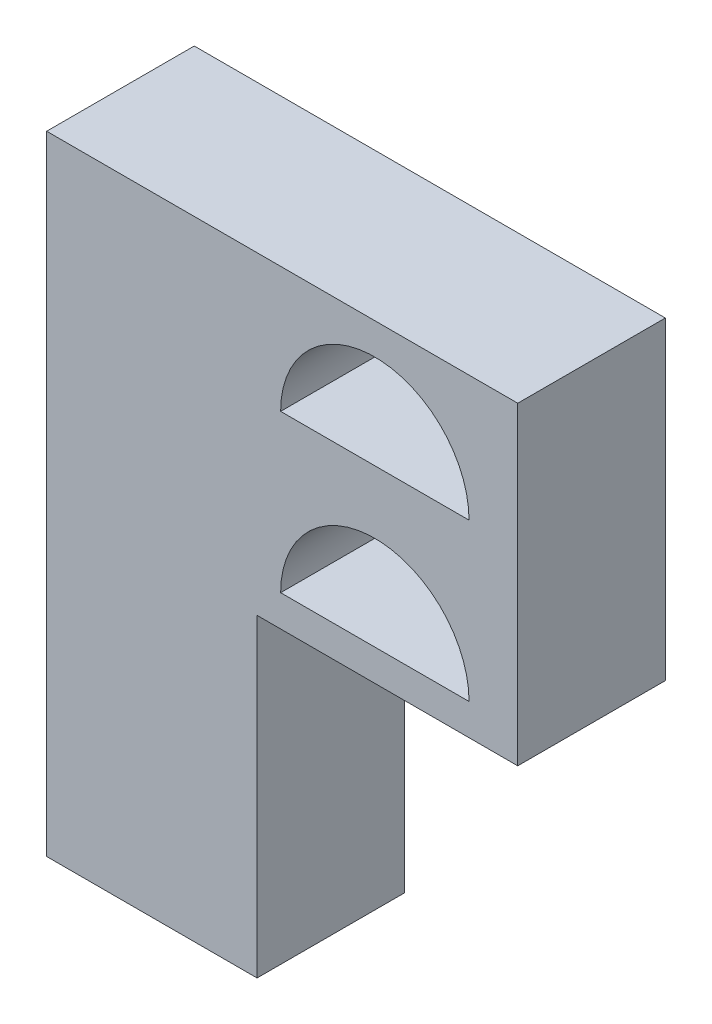
ISO-10303-21;
HEADER;
FILE_DESCRIPTION(('STEP AP214'),'2;1');
FILE_NAME('part.step','',(''),(''),'','','');
FILE_SCHEMA(('AUTOMOTIVE_DESIGN { 1 0 10303 214 1 1 1 1 }'));
ENDSEC;
DATA;
#1=APPLICATION_CONTEXT('core data for automotive mechanical design processes');
#2=APPLICATION_PROTOCOL_DEFINITION('international standard','automotive_design',2000,#1);
#3=PRODUCT_CONTEXT('',#1,'mechanical');
#4=PRODUCT('Part','Part','',(#3));
#5=PRODUCT_RELATED_PRODUCT_CATEGORY('part','',(#4));
#6=PRODUCT_DEFINITION_FORMATION('','',#4);
#7=PRODUCT_DEFINITION_CONTEXT('part definition',#1,'design');
#8=PRODUCT_DEFINITION('design','',#6,#7);
#9=PRODUCT_DEFINITION_SHAPE('','',#8);
#10=(LENGTH_UNIT() NAMED_UNIT(*) SI_UNIT(.MILLI.,.METRE.));
#11=(NAMED_UNIT(*) PLANE_ANGLE_UNIT() SI_UNIT($,.RADIAN.));
#12=(NAMED_UNIT(*) SI_UNIT($,.STERADIAN.) SOLID_ANGLE_UNIT());
#13=UNCERTAINTY_MEASURE_WITH_UNIT(LENGTH_MEASURE(1.E-05),#10,'distance_accuracy_value','');
#14=(GEOMETRIC_REPRESENTATION_CONTEXT(3) GLOBAL_UNCERTAINTY_ASSIGNED_CONTEXT((#13)) GLOBAL_UNIT_ASSIGNED_CONTEXT((#10,
#11,#12)) REPRESENTATION_CONTEXT('',''));
#15=CARTESIAN_POINT('',(0.,0.,0.));
#16=DIRECTION('',(0.,0.,1.));
#17=DIRECTION('',(1.,0.,0.));
#18=AXIS2_PLACEMENT_3D('',#15,#16,#17);
#19=CARTESIAN_POINT('',(11.65,0.,4.7));
#20=DIRECTION('',(1.,0.,0.));
#21=DIRECTION('',(0.,1.,0.));
#22=AXIS2_PLACEMENT_3D('',#19,#20,#21);
#23=PLANE('',#22);
#24=DIRECTION('',(0.,-1.,0.));
#25=VECTOR('',#24,1.);
#26=CARTESIAN_POINT('',(11.65,0.,0.));
#27=LINE('',#26,#25);
#28=CARTESIAN_POINT('',(11.65,15.,0.));
#29=VERTEX_POINT('',#28);
#30=CARTESIAN_POINT('',(11.65,5.,0.));
#31=VERTEX_POINT('',#30);
#32=EDGE_CURVE('E272',#29,#31,#27,.T.);
#33=ORIENTED_EDGE('',*,*,#32,.F.);
#34=DIRECTION('',(0.,0.,-1.));
#35=VECTOR('',#34,1.);
#36=CARTESIAN_POINT('',(11.65,15.,4.7));
#37=LINE('',#36,#35);
#38=CARTESIAN_POINT('',(11.65,15.,4.7));
#39=VERTEX_POINT('',#38);
#40=EDGE_CURVE('E11',#39,#29,#37,.T.);
#41=ORIENTED_EDGE('',*,*,#40,.F.);
#42=DIRECTION('',(0.,-1.,0.));
#43=VECTOR('',#42,1.);
#44=CARTESIAN_POINT('',(11.65,0.,4.7));
#45=LINE('',#44,#43);
#46=CARTESIAN_POINT('',(11.65,5.,4.7));
#47=VERTEX_POINT('',#46);
#48=EDGE_CURVE('E244',#39,#47,#45,.T.);
#49=ORIENTED_EDGE('',*,*,#48,.T.);
#50=DIRECTION('',(0.,0.,-1.));
#51=VECTOR('',#50,1.);
#52=CARTESIAN_POINT('',(11.65,5.,4.7));
#53=LINE('',#52,#51);
#54=EDGE_CURVE('E289',#47,#31,#53,.T.);
#55=ORIENTED_EDGE('',*,*,#54,.T.);
#56=EDGE_LOOP('',(#33,#41,#49,#55));
#57=FACE_BOUND('',#56,.T.);
#58=ADVANCED_FACE('F38',(#57),#23,.T.);
#59=CARTESIAN_POINT('',(0.,15.,4.7));
#60=DIRECTION('',(0.,1.,0.));
#61=DIRECTION('',(0.,0.,1.));
#62=AXIS2_PLACEMENT_3D('',#59,#60,#61);
#63=PLANE('',#62);
#64=DIRECTION('',(1.,0.,0.));
#65=VECTOR('',#64,1.);
#66=CARTESIAN_POINT('',(0.,15.,0.));
#67=LINE('',#66,#65);
#68=CARTESIAN_POINT('',(-3.35,15.,0.));
#69=VERTEX_POINT('',#68);
#70=EDGE_CURVE('E275',#69,#29,#67,.T.);
#71=ORIENTED_EDGE('',*,*,#70,.F.);
#72=DIRECTION('',(0.,0.,-1.));
#73=VECTOR('',#72,1.);
#74=CARTESIAN_POINT('',(-3.35,15.,4.7));
#75=LINE('',#74,#73);
#76=CARTESIAN_POINT('',(-3.35,15.,4.7));
#77=VERTEX_POINT('',#76);
#78=EDGE_CURVE('E47',#77,#69,#75,.T.);
#79=ORIENTED_EDGE('',*,*,#78,.F.);
#80=DIRECTION('',(1.,0.,0.));
#81=VECTOR('',#80,1.);
#82=CARTESIAN_POINT('',(0.,15.,4.7));
#83=LINE('',#82,#81);
#84=EDGE_CURVE('E247',#77,#39,#83,.T.);
#85=ORIENTED_EDGE('',*,*,#84,.T.);
#86=ORIENTED_EDGE('',*,*,#40,.T.);
#87=EDGE_LOOP('',(#71,#79,#85,#86));
#88=FACE_BOUND('',#87,.T.);
#89=ADVANCED_FACE('F325',(#88),#63,.T.);
#90=CARTESIAN_POINT('',(-3.35,0.,4.7));
#91=DIRECTION('',(-1.,0.,0.));
#92=DIRECTION('',(0.,-1.,0.));
#93=AXIS2_PLACEMENT_3D('',#90,#91,#92);
#94=PLANE('',#93);
#95=DIRECTION('',(0.,1.,0.));
#96=VECTOR('',#95,1.);
#97=CARTESIAN_POINT('',(-3.35,14.3472478665135,3.85));
#98=LINE('',#97,#96);
#99=CARTESIAN_POINT('',(-3.35,10.8472478665135,3.85));
#100=VERTEX_POINT('',#99);
#101=CARTESIAN_POINT('',(-3.35,14.3472478665135,3.85));
#102=VERTEX_POINT('',#101);
#103=EDGE_CURVE('E55',#100,#102,#98,.T.);
#104=ORIENTED_EDGE('',*,*,#103,.F.);
#105=DIRECTION('',(0.,0.,1.));
#106=VECTOR('',#105,1.);
#107=CARTESIAN_POINT('',(-3.35,10.8472478665135,0.849999999999997));
#108=LINE('',#107,#106);
#109=CARTESIAN_POINT('',(-3.35,10.8472478665135,0.849999999999997));
#110=VERTEX_POINT('',#109);
#111=EDGE_CURVE('E184',#110,#100,#108,.T.);
#112=ORIENTED_EDGE('',*,*,#111,.F.);
#113=DIRECTION('',(0.,-1.,0.));
#114=VECTOR('',#113,1.);
#115=CARTESIAN_POINT('',(-3.35,14.3472478665135,0.849999999999996));
#116=LINE('',#115,#114);
#117=CARTESIAN_POINT('',(-3.35,14.3472478665135,0.849999999999996));
#118=VERTEX_POINT('',#117);
#119=EDGE_CURVE('E187',#118,#110,#116,.T.);
#120=ORIENTED_EDGE('',*,*,#119,.F.);
#121=DIRECTION('',(0.,0.,-1.));
#122=VECTOR('',#121,1.);
#123=CARTESIAN_POINT('',(-3.35,14.3472478665135,0.849999999999996));
#124=LINE('',#123,#122);
#125=EDGE_CURVE('E193',#102,#118,#124,.T.);
#126=ORIENTED_EDGE('',*,*,#125,.F.);
#127=EDGE_LOOP('',(#104,#112,#120,#126));
#128=FACE_BOUND('',#127,.T.);
#129=DIRECTION('',(0.,-1.,0.));
#130=VECTOR('',#129,1.);
#131=CARTESIAN_POINT('',(-3.35,5.8472478665135,0.849999999999993));
#132=LINE('',#131,#130);
#133=CARTESIAN_POINT('',(-3.35,9.3472478665135,0.849999999999996));
#134=VERTEX_POINT('',#133);
#135=CARTESIAN_POINT('',(-3.35,5.8472478665135,0.849999999999993));
#136=VERTEX_POINT('',#135);
#137=EDGE_CURVE('E63',#134,#136,#132,.T.);
#138=ORIENTED_EDGE('',*,*,#137,.F.);
#139=DIRECTION('',(0.,0.,-1.));
#140=VECTOR('',#139,1.);
#141=CARTESIAN_POINT('',(-3.35,9.3472478665135,0.849999999999996));
#142=LINE('',#141,#140);
#143=CARTESIAN_POINT('',(-3.35,9.3472478665135,3.85));
#144=VERTEX_POINT('',#143);
#145=EDGE_CURVE('E208',#144,#134,#142,.T.);
#146=ORIENTED_EDGE('',*,*,#145,.F.);
#147=DIRECTION('',(0.,1.,0.));
#148=VECTOR('',#147,1.);
#149=CARTESIAN_POINT('',(-3.35,5.8472478665135,3.84999999999999));
#150=LINE('',#149,#148);
#151=CARTESIAN_POINT('',(-3.35,5.8472478665135,3.84999999999999));
#152=VERTEX_POINT('',#151);
#153=EDGE_CURVE('E222',#152,#144,#150,.T.);
#154=ORIENTED_EDGE('',*,*,#153,.F.);
#155=DIRECTION('',(0.,0.,1.));
#156=VECTOR('',#155,1.);
#157=CARTESIAN_POINT('',(-3.35,5.8472478665135,0.849999999999993));
#158=LINE('',#157,#156);
#159=EDGE_CURVE('E219',#136,#152,#158,.T.);
#160=ORIENTED_EDGE('',*,*,#159,.F.);
#161=EDGE_LOOP('',(#138,#146,#154,#160));
#162=FACE_BOUND('',#161,.T.);
#163=DIRECTION('',(0.,1.,0.));
#164=VECTOR('',#163,1.);
#165=CARTESIAN_POINT('',(-3.35,0.,0.));
#166=LINE('',#165,#164);
#167=CARTESIAN_POINT('',(-3.35,-5.,0.));
#168=VERTEX_POINT('',#167);
#169=EDGE_CURVE('E278',#168,#69,#166,.T.);
#170=ORIENTED_EDGE('',*,*,#169,.F.);
#171=DIRECTION('',(0.,0.,-1.));
#172=VECTOR('',#171,1.);
#173=CARTESIAN_POINT('',(-3.35,-5.,4.7));
#174=LINE('',#173,#172);
#175=CARTESIAN_POINT('',(-3.35,-5.,4.7));
#176=VERTEX_POINT('',#175);
#177=EDGE_CURVE('E296',#176,#168,#174,.T.);
#178=ORIENTED_EDGE('',*,*,#177,.F.);
#179=DIRECTION('',(0.,1.,0.));
#180=VECTOR('',#179,1.);
#181=CARTESIAN_POINT('',(-3.35,0.,4.7));
#182=LINE('',#181,#180);
#183=EDGE_CURVE('E250',#176,#77,#182,.T.);
#184=ORIENTED_EDGE('',*,*,#183,.T.);
#185=ORIENTED_EDGE('',*,*,#78,.T.);
#186=EDGE_LOOP('',(#170,#178,#184,#185));
#187=FACE_BOUND('',#186,.T.);
#188=ADVANCED_FACE('F331',(#128,#162,#187),#94,.T.);
#189=CARTESIAN_POINT('',(0.,-5.,4.7));
#190=DIRECTION('',(0.,1.,0.));
#191=DIRECTION('',(0.,0.,1.));
#192=AXIS2_PLACEMENT_3D('',#189,#190,#191);
#193=PLANE('',#192);
#194=DIRECTION('',(1.,0.,0.));
#195=VECTOR('',#194,1.);
#196=CARTESIAN_POINT('',(0.,-5.,0.));
#197=LINE('',#196,#195);
#198=CARTESIAN_POINT('',(3.35,-5.,0.));
#199=VERTEX_POINT('',#198);
#200=EDGE_CURVE('E281',#168,#199,#197,.T.);
#201=ORIENTED_EDGE('',*,*,#200,.T.);
#202=DIRECTION('',(0.,0.,-1.));
#203=VECTOR('',#202,1.);
#204=CARTESIAN_POINT('',(3.35,-5.,4.7));
#205=LINE('',#204,#203);
#206=CARTESIAN_POINT('',(3.35,-5.,4.7));
#207=VERTEX_POINT('',#206);
#208=EDGE_CURVE('E294',#207,#199,#205,.T.);
#209=ORIENTED_EDGE('',*,*,#208,.F.);
#210=DIRECTION('',(1.,0.,0.));
#211=VECTOR('',#210,1.);
#212=CARTESIAN_POINT('',(0.,-5.,4.7));
#213=LINE('',#212,#211);
#214=EDGE_CURVE('E253',#176,#207,#213,.T.);
#215=ORIENTED_EDGE('',*,*,#214,.F.);
#216=ORIENTED_EDGE('',*,*,#177,.T.);
#217=EDGE_LOOP('',(#201,#209,#215,#216));
#218=FACE_BOUND('',#217,.T.);
#219=ADVANCED_FACE('F353',(#218),#193,.F.);
#220=CARTESIAN_POINT('',(3.35,0.,4.7));
#221=DIRECTION('',(1.,0.,0.));
#222=DIRECTION('',(0.,1.,0.));
#223=AXIS2_PLACEMENT_3D('',#220,#221,#222);
#224=PLANE('',#223);
#225=DIRECTION('',(0.,-1.,0.));
#226=VECTOR('',#225,1.);
#227=CARTESIAN_POINT('',(3.35,0.,0.));
#228=LINE('',#227,#226);
#229=CARTESIAN_POINT('',(3.35,5.,0.));
#230=VERTEX_POINT('',#229);
#231=EDGE_CURVE('E284',#230,#199,#228,.T.);
#232=ORIENTED_EDGE('',*,*,#231,.F.);
#233=DIRECTION('',(0.,0.,-1.));
#234=VECTOR('',#233,1.);
#235=CARTESIAN_POINT('',(3.35,5.,4.7));
#236=LINE('',#235,#234);
#237=CARTESIAN_POINT('',(3.35,5.,4.7));
#238=VERTEX_POINT('',#237);
#239=EDGE_CURVE('E291',#238,#230,#236,.T.);
#240=ORIENTED_EDGE('',*,*,#239,.F.);
#241=DIRECTION('',(0.,-1.,0.));
#242=VECTOR('',#241,1.);
#243=CARTESIAN_POINT('',(3.35,0.,4.7));
#244=LINE('',#243,#242);
#245=EDGE_CURVE('E255',#238,#207,#244,.T.);
#246=ORIENTED_EDGE('',*,*,#245,.T.);
#247=ORIENTED_EDGE('',*,*,#208,.T.);
#248=EDGE_LOOP('',(#232,#240,#246,#247));
#249=FACE_BOUND('',#248,.T.);
#250=ADVANCED_FACE('F321',(#249),#224,.T.);
#251=CARTESIAN_POINT('',(7.1,11.,4.7));
#252=DIRECTION('',(0.,0.,-1.));
#253=DIRECTION('',(-1.,0.,0.));
#254=AXIS2_PLACEMENT_3D('',#251,#252,#253);
#255=CYLINDRICAL_SURFACE('',#254,3.);
#256=CARTESIAN_POINT('',(7.1,11.,0.));
#257=DIRECTION('',(0.,0.,1.));
#258=DIRECTION('',(1.,0.,0.));
#259=AXIS2_PLACEMENT_3D('',#256,#257,#258);
#260=CIRCLE('',#259,3.);
#261=CARTESIAN_POINT('',(10.1,11.,0.));
#262=VERTEX_POINT('',#261);
#263=CARTESIAN_POINT('',(4.1,11.,0.));
#264=VERTEX_POINT('',#263);
#265=EDGE_CURVE('E266',#262,#264,#260,.T.);
#266=ORIENTED_EDGE('',*,*,#265,.F.);
#267=DIRECTION('',(0.,0.,-1.));
#268=VECTOR('',#267,1.);
#269=CARTESIAN_POINT('',(10.1,11.,4.7));
#270=LINE('',#269,#268);
#271=CARTESIAN_POINT('',(10.1,11.,4.7));
#272=VERTEX_POINT('',#271);
#273=EDGE_CURVE('E292',#272,#262,#270,.T.);
#274=ORIENTED_EDGE('',*,*,#273,.F.);
#275=CARTESIAN_POINT('',(7.1,11.,4.7));
#276=DIRECTION('',(0.,0.,1.));
#277=DIRECTION('',(1.,0.,0.));
#278=AXIS2_PLACEMENT_3D('',#275,#276,#277);
#279=CIRCLE('',#278,3.);
#280=CARTESIAN_POINT('',(4.1,11.,4.7));
#281=VERTEX_POINT('',#280);
#282=EDGE_CURVE('E239',#272,#281,#279,.T.);
#283=ORIENTED_EDGE('',*,*,#282,.T.);
#284=DIRECTION('',(0.,0.,-1.));
#285=VECTOR('',#284,1.);
#286=CARTESIAN_POINT('',(4.1,11.,4.7));
#287=LINE('',#286,#285);
#288=EDGE_CURVE('E299',#281,#264,#287,.T.);
#289=ORIENTED_EDGE('',*,*,#288,.T.);
#290=EDGE_LOOP('',(#266,#274,#283,#289));
#291=FACE_BOUND('',#290,.T.);
#292=ADVANCED_FACE('F314',(#291),#255,.F.);
#293=CARTESIAN_POINT('',(7.10000000000005,6.,4.7));
#294=DIRECTION('',(0.,0.,-1.));
#295=DIRECTION('',(-1.,0.,0.));
#296=AXIS2_PLACEMENT_3D('',#293,#294,#295);
#297=CYLINDRICAL_SURFACE('',#296,3.);
#298=CARTESIAN_POINT('',(7.10000000000005,6.,0.));
#299=DIRECTION('',(0.,0.,1.));
#300=DIRECTION('',(1.,0.,0.));
#301=AXIS2_PLACEMENT_3D('',#298,#299,#300);
#302=CIRCLE('',#301,3.);
#303=CARTESIAN_POINT('',(10.1,6.,0.));
#304=VERTEX_POINT('',#303);
#305=CARTESIAN_POINT('',(4.10000000000005,6.,0.));
#306=VERTEX_POINT('',#305);
#307=EDGE_CURVE('E200',#304,#306,#302,.T.);
#308=ORIENTED_EDGE('',*,*,#307,.F.);
#309=DIRECTION('',(0.,0.,-1.));
#310=VECTOR('',#309,1.);
#311=CARTESIAN_POINT('',(10.1,6.,4.7));
#312=LINE('',#311,#310);
#313=CARTESIAN_POINT('',(10.1,6.,4.7));
#314=VERTEX_POINT('',#313);
#315=EDGE_CURVE('E42',#314,#304,#312,.T.);
#316=ORIENTED_EDGE('',*,*,#315,.F.);
#317=CARTESIAN_POINT('',(7.10000000000005,6.,4.7));
#318=DIRECTION('',(0.,0.,1.));
#319=DIRECTION('',(1.,0.,0.));
#320=AXIS2_PLACEMENT_3D('',#317,#318,#319);
#321=CIRCLE('',#320,3.);
#322=CARTESIAN_POINT('',(4.10000000000005,6.,4.7));
#323=VERTEX_POINT('',#322);
#324=EDGE_CURVE('E233',#314,#323,#321,.T.);
#325=ORIENTED_EDGE('',*,*,#324,.T.);
#326=DIRECTION('',(0.,0.,-1.));
#327=VECTOR('',#326,1.);
#328=CARTESIAN_POINT('',(4.10000000000005,6.,4.7));
#329=LINE('',#328,#327);
#330=EDGE_CURVE('E260',#323,#306,#329,.T.);
#331=ORIENTED_EDGE('',*,*,#330,.T.);
#332=EDGE_LOOP('',(#308,#316,#325,#331));
#333=FACE_BOUND('',#332,.T.);
#334=ADVANCED_FACE('F40',(#333),#297,.F.);
#335=CARTESIAN_POINT('',(0.,11.,4.7));
#336=DIRECTION('',(0.,-1.,0.));
#337=DIRECTION('',(1.,0.,0.));
#338=AXIS2_PLACEMENT_3D('',#335,#336,#337);
#339=PLANE('',#338);
#340=DIRECTION('',(-1.,0.,0.));
#341=VECTOR('',#340,1.);
#342=CARTESIAN_POINT('',(0.,11.,0.));
#343=LINE('',#342,#341);
#344=EDGE_CURVE('E269',#262,#264,#343,.T.);
#345=ORIENTED_EDGE('',*,*,#344,.T.);
#346=ORIENTED_EDGE('',*,*,#288,.F.);
#347=DIRECTION('',(-1.,0.,0.));
#348=VECTOR('',#347,1.);
#349=CARTESIAN_POINT('',(0.,11.,4.7));
#350=LINE('',#349,#348);
#351=EDGE_CURVE('E242',#272,#281,#350,.T.);
#352=ORIENTED_EDGE('',*,*,#351,.F.);
#353=ORIENTED_EDGE('',*,*,#273,.T.);
#354=EDGE_LOOP('',(#345,#346,#352,#353));
#355=FACE_BOUND('',#354,.T.);
#356=ADVANCED_FACE('F313',(#355),#339,.F.);
#357=CARTESIAN_POINT('',(0.,5.99999999999999,4.7));
#358=DIRECTION('',(0.,-1.,0.));
#359=DIRECTION('',(1.,0.,0.));
#360=AXIS2_PLACEMENT_3D('',#357,#358,#359);
#361=PLANE('',#360);
#362=DIRECTION('',(-1.,0.,0.));
#363=VECTOR('',#362,1.);
#364=CARTESIAN_POINT('',(0.,5.99999999999999,0.));
#365=LINE('',#364,#363);
#366=EDGE_CURVE('E263',#304,#306,#365,.T.);
#367=ORIENTED_EDGE('',*,*,#366,.T.);
#368=ORIENTED_EDGE('',*,*,#330,.F.);
#369=DIRECTION('',(-1.,0.,0.));
#370=VECTOR('',#369,1.);
#371=CARTESIAN_POINT('',(0.,5.99999999999999,4.7));
#372=LINE('',#371,#370);
#373=EDGE_CURVE('E236',#314,#323,#372,.T.);
#374=ORIENTED_EDGE('',*,*,#373,.F.);
#375=ORIENTED_EDGE('',*,*,#315,.T.);
#376=EDGE_LOOP('',(#367,#368,#374,#375));
#377=FACE_BOUND('',#376,.T.);
#378=ADVANCED_FACE('F307',(#377),#361,.F.);
#379=CARTESIAN_POINT('',(0.,5.,4.7));
#380=DIRECTION('',(0.,1.,0.));
#381=DIRECTION('',(0.,0.,1.));
#382=AXIS2_PLACEMENT_3D('',#379,#380,#381);
#383=PLANE('',#382);
#384=DIRECTION('',(1.,0.,0.));
#385=VECTOR('',#384,1.);
#386=CARTESIAN_POINT('',(0.,5.,0.));
#387=LINE('',#386,#385);
#388=EDGE_CURVE('E237',#230,#31,#387,.T.);
#389=ORIENTED_EDGE('',*,*,#388,.T.);
#390=ORIENTED_EDGE('',*,*,#54,.F.);
#391=DIRECTION('',(1.,0.,0.));
#392=VECTOR('',#391,1.);
#393=CARTESIAN_POINT('',(0.,5.,4.7));
#394=LINE('',#393,#392);
#395=EDGE_CURVE('E258',#238,#47,#394,.T.);
#396=ORIENTED_EDGE('',*,*,#395,.F.);
#397=ORIENTED_EDGE('',*,*,#239,.T.);
#398=EDGE_LOOP('',(#389,#390,#396,#397));
#399=FACE_BOUND('',#398,.T.);
#400=ADVANCED_FACE('F337',(#399),#383,.F.);
#401=CARTESIAN_POINT('',(0.,0.,4.7));
#402=DIRECTION('',(0.,0.,1.));
#403=DIRECTION('',(1.,0.,0.));
#404=AXIS2_PLACEMENT_3D('',#401,#402,#403);
#405=PLANE('',#404);
#406=ORIENTED_EDGE('',*,*,#324,.F.);
#407=ORIENTED_EDGE('',*,*,#373,.T.);
#408=EDGE_LOOP('',(#406,#407));
#409=FACE_BOUND('',#408,.T.);
#410=ORIENTED_EDGE('',*,*,#282,.F.);
#411=ORIENTED_EDGE('',*,*,#351,.T.);
#412=EDGE_LOOP('',(#410,#411));
#413=FACE_BOUND('',#412,.T.);
#414=ORIENTED_EDGE('',*,*,#48,.F.);
#415=ORIENTED_EDGE('',*,*,#84,.F.);
#416=ORIENTED_EDGE('',*,*,#183,.F.);
#417=ORIENTED_EDGE('',*,*,#214,.T.);
#418=ORIENTED_EDGE('',*,*,#245,.F.);
#419=ORIENTED_EDGE('',*,*,#395,.T.);
#420=EDGE_LOOP('',(#414,#415,#416,#417,#418,#419));
#421=FACE_BOUND('',#420,.T.);
#422=ADVANCED_FACE('F341',(#409,#413,#421),#405,.T.);
#423=CARTESIAN_POINT('',(0.,0.,0.));
#424=DIRECTION('',(0.,0.,1.));
#425=DIRECTION('',(1.,0.,0.));
#426=AXIS2_PLACEMENT_3D('',#423,#424,#425);
#427=PLANE('',#426);
#428=ORIENTED_EDGE('',*,*,#307,.T.);
#429=ORIENTED_EDGE('',*,*,#366,.F.);
#430=EDGE_LOOP('',(#428,#429));
#431=FACE_BOUND('',#430,.T.);
#432=ORIENTED_EDGE('',*,*,#265,.T.);
#433=ORIENTED_EDGE('',*,*,#344,.F.);
#434=EDGE_LOOP('',(#432,#433));
#435=FACE_BOUND('',#434,.T.);
#436=ORIENTED_EDGE('',*,*,#32,.T.);
#437=ORIENTED_EDGE('',*,*,#388,.F.);
#438=ORIENTED_EDGE('',*,*,#231,.T.);
#439=ORIENTED_EDGE('',*,*,#200,.F.);
#440=ORIENTED_EDGE('',*,*,#169,.T.);
#441=ORIENTED_EDGE('',*,*,#70,.T.);
#442=EDGE_LOOP('',(#436,#437,#438,#439,#440,#441));
#443=FACE_BOUND('',#442,.T.);
#444=ADVANCED_FACE('F310',(#431,#435,#443),#427,.F.);
#445=CARTESIAN_POINT('',(1.65,5.8472478665135,0.849999999999993));
#446=DIRECTION('',(0.,0.,-1.));
#447=DIRECTION('',(0.,1.,0.));
#448=AXIS2_PLACEMENT_3D('',#445,#446,#447);
#449=PLANE('',#448);
#450=ORIENTED_EDGE('',*,*,#137,.T.);
#451=DIRECTION('',(-1.,0.,0.));
#452=VECTOR('',#451,1.);
#453=CARTESIAN_POINT('',(1.65,5.8472478665135,0.849999999999993));
#454=LINE('',#453,#452);
#455=CARTESIAN_POINT('',(1.65,5.8472478665135,0.849999999999993));
#456=VERTEX_POINT('',#455);
#457=EDGE_CURVE('E217',#456,#136,#454,.T.);
#458=ORIENTED_EDGE('',*,*,#457,.F.);
#459=DIRECTION('',(0.,-1.,0.));
#460=VECTOR('',#459,1.);
#461=CARTESIAN_POINT('',(1.65,5.8472478665135,0.849999999999993));
#462=LINE('',#461,#460);
#463=CARTESIAN_POINT('',(1.65,9.3472478665135,0.849999999999996));
#464=VERTEX_POINT('',#463);
#465=EDGE_CURVE('E204',#464,#456,#462,.T.);
#466=ORIENTED_EDGE('',*,*,#465,.F.);
#467=DIRECTION('',(-1.,0.,0.));
#468=VECTOR('',#467,1.);
#469=CARTESIAN_POINT('',(1.65,9.3472478665135,0.849999999999996));
#470=LINE('',#469,#468);
#471=EDGE_CURVE('E194',#464,#134,#470,.T.);
#472=ORIENTED_EDGE('',*,*,#471,.T.);
#473=EDGE_LOOP('',(#450,#458,#466,#472));
#474=FACE_BOUND('',#473,.T.);
#475=ADVANCED_FACE('F382',(#474),#449,.F.);
#476=CARTESIAN_POINT('',(1.65,9.3472478665135,0.849999999999996));
#477=DIRECTION('',(0.,1.,0.));
#478=DIRECTION('',(0.,0.,1.));
#479=AXIS2_PLACEMENT_3D('',#476,#477,#478);
#480=PLANE('',#479);
#481=ORIENTED_EDGE('',*,*,#145,.T.);
#482=ORIENTED_EDGE('',*,*,#471,.F.);
#483=DIRECTION('',(0.,0.,-1.));
#484=VECTOR('',#483,1.);
#485=CARTESIAN_POINT('',(1.65,9.3472478665135,0.849999999999996));
#486=LINE('',#485,#484);
#487=CARTESIAN_POINT('',(1.65,9.3472478665135,3.85));
#488=VERTEX_POINT('',#487);
#489=EDGE_CURVE('E214',#488,#464,#486,.T.);
#490=ORIENTED_EDGE('',*,*,#489,.F.);
#491=DIRECTION('',(-1.,0.,0.));
#492=VECTOR('',#491,1.);
#493=CARTESIAN_POINT('',(1.65,9.3472478665135,3.85));
#494=LINE('',#493,#492);
#495=EDGE_CURVE('E228',#488,#144,#494,.T.);
#496=ORIENTED_EDGE('',*,*,#495,.T.);
#497=EDGE_LOOP('',(#481,#482,#490,#496));
#498=FACE_BOUND('',#497,.T.);
#499=ADVANCED_FACE('F386',(#498),#480,.F.);
#500=CARTESIAN_POINT('',(1.65,5.8472478665135,3.84999999999999));
#501=DIRECTION('',(0.,0.,1.));
#502=DIRECTION('',(0.,-1.,0.));
#503=AXIS2_PLACEMENT_3D('',#500,#501,#502);
#504=PLANE('',#503);
#505=ORIENTED_EDGE('',*,*,#153,.T.);
#506=ORIENTED_EDGE('',*,*,#495,.F.);
#507=DIRECTION('',(0.,1.,0.));
#508=VECTOR('',#507,1.);
#509=CARTESIAN_POINT('',(1.65,5.8472478665135,3.84999999999999));
#510=LINE('',#509,#508);
#511=CARTESIAN_POINT('',(1.65,5.8472478665135,3.84999999999999));
#512=VERTEX_POINT('',#511);
#513=EDGE_CURVE('E211',#512,#488,#510,.T.);
#514=ORIENTED_EDGE('',*,*,#513,.F.);
#515=DIRECTION('',(-1.,0.,0.));
#516=VECTOR('',#515,1.);
#517=CARTESIAN_POINT('',(1.65,5.8472478665135,3.84999999999999));
#518=LINE('',#517,#516);
#519=EDGE_CURVE('E230',#512,#152,#518,.T.);
#520=ORIENTED_EDGE('',*,*,#519,.T.);
#521=EDGE_LOOP('',(#505,#506,#514,#520));
#522=FACE_BOUND('',#521,.T.);
#523=ADVANCED_FACE('F391',(#522),#504,.F.);
#524=CARTESIAN_POINT('',(1.65,5.8472478665135,0.849999999999993));
#525=DIRECTION('',(0.,-1.,0.));
#526=DIRECTION('',(0.,0.,-1.));
#527=AXIS2_PLACEMENT_3D('',#524,#525,#526);
#528=PLANE('',#527);
#529=ORIENTED_EDGE('',*,*,#159,.T.);
#530=ORIENTED_EDGE('',*,*,#519,.F.);
#531=DIRECTION('',(0.,0.,1.));
#532=VECTOR('',#531,1.);
#533=CARTESIAN_POINT('',(1.65,5.8472478665135,0.849999999999993));
#534=LINE('',#533,#532);
#535=EDGE_CURVE('E207',#456,#512,#534,.T.);
#536=ORIENTED_EDGE('',*,*,#535,.F.);
#537=ORIENTED_EDGE('',*,*,#457,.T.);
#538=EDGE_LOOP('',(#529,#530,#536,#537));
#539=FACE_BOUND('',#538,.T.);
#540=ADVANCED_FACE('F395',(#539),#528,.F.);
#541=CARTESIAN_POINT('',(1.65,0.,0.));
#542=DIRECTION('',(1.,0.,0.));
#543=DIRECTION('',(0.,0.,-1.));
#544=AXIS2_PLACEMENT_3D('',#541,#542,#543);
#545=PLANE('',#544);
#546=ORIENTED_EDGE('',*,*,#465,.T.);
#547=ORIENTED_EDGE('',*,*,#535,.T.);
#548=ORIENTED_EDGE('',*,*,#513,.T.);
#549=ORIENTED_EDGE('',*,*,#489,.T.);
#550=EDGE_LOOP('',(#546,#547,#548,#549));
#551=FACE_BOUND('',#550,.T.);
#552=ADVANCED_FACE('F398',(#551),#545,.F.);
#553=CARTESIAN_POINT('',(1.65,14.3472478665135,3.85));
#554=DIRECTION('',(0.,0.,1.));
#555=DIRECTION('',(1.,0.,0.));
#556=AXIS2_PLACEMENT_3D('',#553,#554,#555);
#557=PLANE('',#556);
#558=ORIENTED_EDGE('',*,*,#103,.T.);
#559=DIRECTION('',(-1.,0.,0.));
#560=VECTOR('',#559,1.);
#561=CARTESIAN_POINT('',(1.65,14.3472478665135,3.85));
#562=LINE('',#561,#560);
#563=CARTESIAN_POINT('',(1.65,14.3472478665135,3.85));
#564=VERTEX_POINT('',#563);
#565=EDGE_CURVE('E162',#564,#102,#562,.T.);
#566=ORIENTED_EDGE('',*,*,#565,.F.);
#567=DIRECTION('',(0.,1.,0.));
#568=VECTOR('',#567,1.);
#569=CARTESIAN_POINT('',(1.65,14.3472478665135,3.85));
#570=LINE('',#569,#568);
#571=CARTESIAN_POINT('',(1.65,10.8472478665135,3.85));
#572=VERTEX_POINT('',#571);
#573=EDGE_CURVE('E166',#572,#564,#570,.T.);
#574=ORIENTED_EDGE('',*,*,#573,.F.);
#575=DIRECTION('',(-1.,0.,0.));
#576=VECTOR('',#575,1.);
#577=CARTESIAN_POINT('',(1.65,10.8472478665135,3.85));
#578=LINE('',#577,#576);
#579=EDGE_CURVE('E198',#572,#100,#578,.T.);
#580=ORIENTED_EDGE('',*,*,#579,.T.);
#581=EDGE_LOOP('',(#558,#566,#574,#580));
#582=FACE_BOUND('',#581,.T.);
#583=ADVANCED_FACE('F164',(#582),#557,.F.);
#584=CARTESIAN_POINT('',(1.65,10.8472478665135,0.849999999999997));
#585=DIRECTION('',(0.,-1.,0.));
#586=DIRECTION('',(0.,0.,-1.));
#587=AXIS2_PLACEMENT_3D('',#584,#585,#586);
#588=PLANE('',#587);
#589=ORIENTED_EDGE('',*,*,#111,.T.);
#590=ORIENTED_EDGE('',*,*,#579,.F.);
#591=DIRECTION('',(0.,0.,1.));
#592=VECTOR('',#591,1.);
#593=CARTESIAN_POINT('',(1.65,10.8472478665135,0.849999999999997));
#594=LINE('',#593,#592);
#595=CARTESIAN_POINT('',(1.65,10.8472478665135,0.849999999999997));
#596=VERTEX_POINT('',#595);
#597=EDGE_CURVE('E172',#596,#572,#594,.T.);
#598=ORIENTED_EDGE('',*,*,#597,.F.);
#599=DIRECTION('',(-1.,0.,0.));
#600=VECTOR('',#599,1.);
#601=CARTESIAN_POINT('',(1.65,10.8472478665135,0.849999999999997));
#602=LINE('',#601,#600);
#603=EDGE_CURVE('E201',#596,#110,#602,.T.);
#604=ORIENTED_EDGE('',*,*,#603,.T.);
#605=EDGE_LOOP('',(#589,#590,#598,#604));
#606=FACE_BOUND('',#605,.T.);
#607=ADVANCED_FACE('F408',(#606),#588,.F.);
#608=CARTESIAN_POINT('',(1.65,14.3472478665135,0.849999999999996));
#609=DIRECTION('',(0.,0.,-1.));
#610=DIRECTION('',(0.,1.,0.));
#611=AXIS2_PLACEMENT_3D('',#608,#609,#610);
#612=PLANE('',#611);
#613=ORIENTED_EDGE('',*,*,#119,.T.);
#614=ORIENTED_EDGE('',*,*,#603,.F.);
#615=DIRECTION('',(0.,-1.,0.));
#616=VECTOR('',#615,1.);
#617=CARTESIAN_POINT('',(1.65,14.3472478665135,0.849999999999996));
#618=LINE('',#617,#616);
#619=CARTESIAN_POINT('',(1.65,14.3472478665135,0.849999999999996));
#620=VERTEX_POINT('',#619);
#621=EDGE_CURVE('E180',#620,#596,#618,.T.);
#622=ORIENTED_EDGE('',*,*,#621,.F.);
#623=DIRECTION('',(-1.,0.,0.));
#624=VECTOR('',#623,1.);
#625=CARTESIAN_POINT('',(1.65,14.3472478665135,0.849999999999996));
#626=LINE('',#625,#624);
#627=EDGE_CURVE('E171',#620,#118,#626,.T.);
#628=ORIENTED_EDGE('',*,*,#627,.T.);
#629=EDGE_LOOP('',(#613,#614,#622,#628));
#630=FACE_BOUND('',#629,.T.);
#631=ADVANCED_FACE('F411',(#630),#612,.F.);
#632=CARTESIAN_POINT('',(1.65,14.3472478665135,0.849999999999996));
#633=DIRECTION('',(0.,1.,0.));
#634=DIRECTION('',(0.,0.,1.));
#635=AXIS2_PLACEMENT_3D('',#632,#633,#634);
#636=PLANE('',#635);
#637=ORIENTED_EDGE('',*,*,#125,.T.);
#638=ORIENTED_EDGE('',*,*,#627,.F.);
#639=DIRECTION('',(0.,0.,-1.));
#640=VECTOR('',#639,1.);
#641=CARTESIAN_POINT('',(1.65,14.3472478665135,0.849999999999996));
#642=LINE('',#641,#640);
#643=EDGE_CURVE('E175',#564,#620,#642,.T.);
#644=ORIENTED_EDGE('',*,*,#643,.F.);
#645=ORIENTED_EDGE('',*,*,#565,.T.);
#646=EDGE_LOOP('',(#637,#638,#644,#645));
#647=FACE_BOUND('',#646,.T.);
#648=ADVANCED_FACE('F176',(#647),#636,.F.);
#649=CARTESIAN_POINT('',(1.65,0.,0.));
#650=DIRECTION('',(-1.,0.,0.));
#651=DIRECTION('',(0.,0.,1.));
#652=AXIS2_PLACEMENT_3D('',#649,#650,#651);
#653=PLANE('',#652);
#654=ORIENTED_EDGE('',*,*,#573,.T.);
#655=ORIENTED_EDGE('',*,*,#643,.T.);
#656=ORIENTED_EDGE('',*,*,#621,.T.);
#657=ORIENTED_EDGE('',*,*,#597,.T.);
#658=EDGE_LOOP('',(#654,#655,#656,#657));
#659=FACE_BOUND('',#658,.T.);
#660=ADVANCED_FACE('F182',(#659),#653,.T.);
#661=CLOSED_SHELL('',(#58,#89,#188,#219,#250,#292,#334,#356,#378,#400,#422,#444,#475,#499,#523,
#540,#552,#583,#607,#631,#648,#660));
#662=MANIFOLD_SOLID_BREP('B2',#661);
#663=ADVANCED_BREP_SHAPE_REPRESENTATION('',(#18,#662),#14);
#664=SHAPE_DEFINITION_REPRESENTATION(#9,#663);
ENDSEC;
END-ISO-10303-21;
